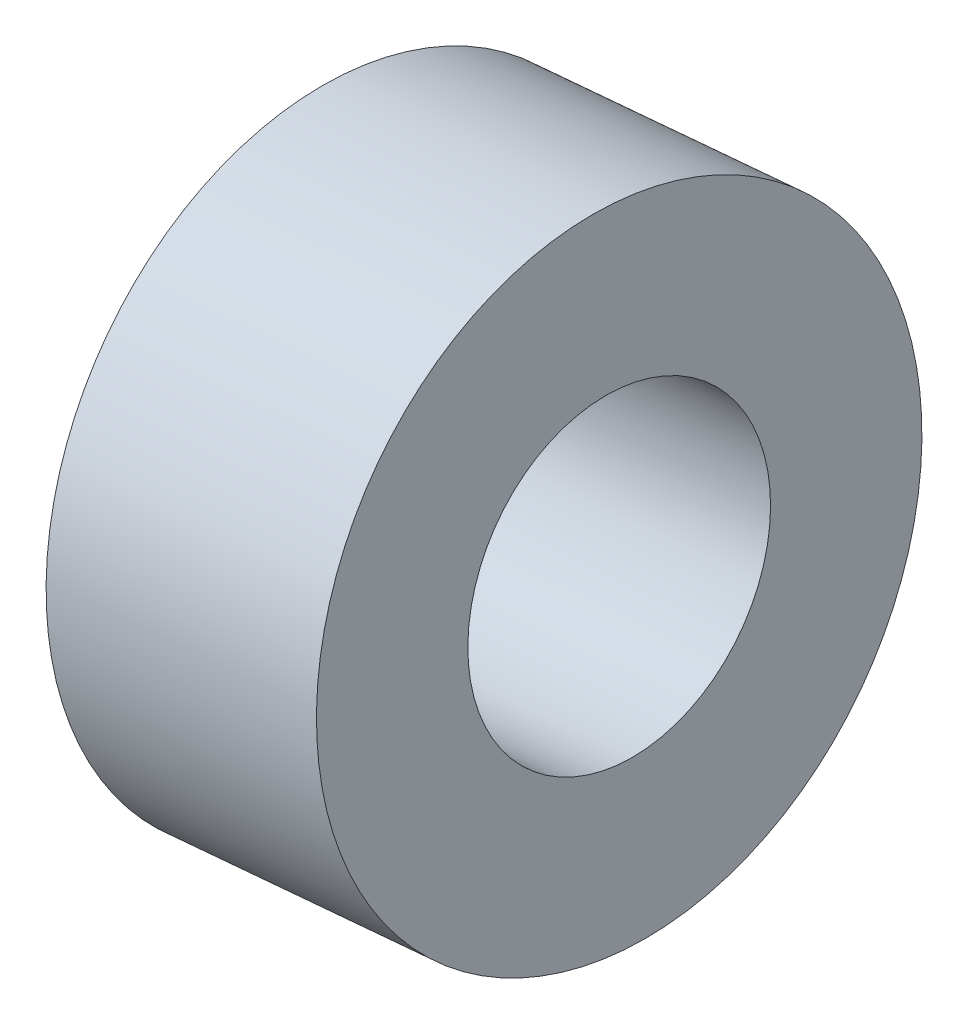
ISO-10303-21;
HEADER;
FILE_DESCRIPTION(('STEP AP214'),'2;1');
FILE_NAME('part.step','',(''),(''),'','','');
FILE_SCHEMA(('AUTOMOTIVE_DESIGN { 1 0 10303 214 1 1 1 1 }'));
ENDSEC;
DATA;
#1=APPLICATION_CONTEXT('core data for automotive mechanical design processes');
#2=APPLICATION_PROTOCOL_DEFINITION('international standard','automotive_design',2000,#1);
#3=PRODUCT_CONTEXT('',#1,'mechanical');
#4=PRODUCT('Part','Part','',(#3));
#5=PRODUCT_RELATED_PRODUCT_CATEGORY('part','',(#4));
#6=PRODUCT_DEFINITION_FORMATION('','',#4);
#7=PRODUCT_DEFINITION_CONTEXT('part definition',#1,'design');
#8=PRODUCT_DEFINITION('design','',#6,#7);
#9=PRODUCT_DEFINITION_SHAPE('','',#8);
#10=(LENGTH_UNIT() NAMED_UNIT(*) SI_UNIT(.MILLI.,.METRE.));
#11=(NAMED_UNIT(*) PLANE_ANGLE_UNIT() SI_UNIT($,.RADIAN.));
#12=(NAMED_UNIT(*) SI_UNIT($,.STERADIAN.) SOLID_ANGLE_UNIT());
#13=UNCERTAINTY_MEASURE_WITH_UNIT(LENGTH_MEASURE(1.E-05),#10,'distance_accuracy_value','');
#14=(GEOMETRIC_REPRESENTATION_CONTEXT(3) GLOBAL_UNCERTAINTY_ASSIGNED_CONTEXT((#13)) GLOBAL_UNIT_ASSIGNED_CONTEXT((#10,
#11,#12)) REPRESENTATION_CONTEXT('',''));
#15=CARTESIAN_POINT('',(0.,0.,0.));
#16=DIRECTION('',(0.,0.,1.));
#17=DIRECTION('',(1.,0.,0.));
#18=AXIS2_PLACEMENT_3D('',#15,#16,#17);
#19=CARTESIAN_POINT('',(-26.8972568484767,22.6467949458148,-2.08166817117217E-13));
#20=DIRECTION('',(-0.996194698091746,-0.0871557427476605,0.));
#21=DIRECTION('',(0.0871557427476582,-0.996194698091781,0.));
#22=AXIS2_PLACEMENT_3D('',#19,#20,#21);
#23=CYLINDRICAL_SURFACE('',#22,20.);
#24=CARTESIAN_POINT('',(-26.8972568484767,22.6467949458148,-2.08166817117217E-13));
#25=DIRECTION('',(-0.996194698091746,-0.0871557427476605,0.));
#26=DIRECTION('',(0.0871557427476582,-0.996194698091781,0.));
#27=AXIS2_PLACEMENT_3D('',#24,#25,#26);
#28=CIRCLE('',#27,20.);
#29=CARTESIAN_POINT('',(-25.1541419935235,2.72290098397922,-2.08166817117217E-13));
#30=VERTEX_POINT('',#29);
#31=EDGE_CURVE('E10',#30,#30,#28,.T.);
#32=ORIENTED_EDGE('',*,*,#31,.T.);
#33=EDGE_LOOP('',(#32));
#34=FACE_BOUND('',#33,.T.);
#35=CARTESIAN_POINT('',(-44.8287614141281,21.077991576357,0.));
#36=DIRECTION('',(-0.996194698091746,-0.0871557427476605,0.));
#37=DIRECTION('',(0.0871557427476582,-0.996194698091781,0.));
#38=AXIS2_PLACEMENT_3D('',#35,#36,#37);
#39=CIRCLE('',#38,20.);
#40=CARTESIAN_POINT('',(-43.0856465591749,1.15409761452136,0.));
#41=VERTEX_POINT('',#40);
#42=EDGE_CURVE('E37',#41,#41,#39,.T.);
#43=ORIENTED_EDGE('',*,*,#42,.F.);
#44=EDGE_LOOP('',(#43));
#45=FACE_BOUND('',#44,.T.);
#46=ADVANCED_FACE('F34',(#34,#45),#23,.T.);
#47=CARTESIAN_POINT('',(-26.8972568484767,22.6467949458148,-2.08166817117217E-13));
#48=DIRECTION('',(-0.996194698091746,-0.0871557427476605,0.));
#49=DIRECTION('',(0.0871557427476582,-0.996194698091781,0.));
#50=AXIS2_PLACEMENT_3D('',#47,#48,#49);
#51=PLANE('',#50);
#52=CARTESIAN_POINT('',(-26.8972568484767,22.6467949458148,-2.08166817117217E-13));
#53=DIRECTION('',(-0.996194698091746,-0.0871557427476605,0.));
#54=DIRECTION('',(0.0871557427476582,-0.996194698091781,0.));
#55=AXIS2_PLACEMENT_3D('',#52,#53,#54);
#56=CIRCLE('',#55,10.);
#57=CARTESIAN_POINT('',(-26.0256994210001,12.684847964897,-2.08166817117217E-13));
#58=VERTEX_POINT('',#57);
#59=EDGE_CURVE('E44',#58,#58,#56,.T.);
#60=ORIENTED_EDGE('',*,*,#59,.T.);
#61=EDGE_LOOP('',(#60));
#62=FACE_BOUND('',#61,.T.);
#63=ORIENTED_EDGE('',*,*,#31,.F.);
#64=EDGE_LOOP('',(#63));
#65=FACE_BOUND('',#64,.T.);
#66=ADVANCED_FACE('F52',(#62,#65),#51,.F.);
#67=CARTESIAN_POINT('',(-44.8287614141281,21.077991576357,0.));
#68=DIRECTION('',(-0.996194698091746,-0.0871557427476605,0.));
#69=DIRECTION('',(0.0871557427476582,-0.996194698091781,0.));
#70=AXIS2_PLACEMENT_3D('',#67,#68,#69);
#71=PLANE('',#70);
#72=CARTESIAN_POINT('',(-44.8287614141281,21.077991576357,0.));
#73=DIRECTION('',(-0.996194698091746,-0.0871557427476605,0.));
#74=DIRECTION('',(0.0871557427476582,-0.996194698091781,0.));
#75=AXIS2_PLACEMENT_3D('',#72,#73,#74);
#76=CIRCLE('',#75,10.);
#77=CARTESIAN_POINT('',(-43.9572039866515,11.1160445954392,0.));
#78=VERTEX_POINT('',#77);
#79=EDGE_CURVE('E46',#78,#78,#76,.T.);
#80=ORIENTED_EDGE('',*,*,#79,.F.);
#81=EDGE_LOOP('',(#80));
#82=FACE_BOUND('',#81,.T.);
#83=ORIENTED_EDGE('',*,*,#42,.T.);
#84=EDGE_LOOP('',(#83));
#85=FACE_BOUND('',#84,.T.);
#86=ADVANCED_FACE('F58',(#82,#85),#71,.T.);
#87=CARTESIAN_POINT('',(-26.8972568484767,22.6467949458148,-2.08166817117217E-13));
#88=DIRECTION('',(-0.996194698091746,-0.0871557427476605,0.));
#89=DIRECTION('',(0.0871557427476582,-0.996194698091781,0.));
#90=AXIS2_PLACEMENT_3D('',#87,#88,#89);
#91=CYLINDRICAL_SURFACE('',#90,10.);
#92=ORIENTED_EDGE('',*,*,#59,.F.);
#93=EDGE_LOOP('',(#92));
#94=FACE_BOUND('',#93,.T.);
#95=ORIENTED_EDGE('',*,*,#79,.T.);
#96=EDGE_LOOP('',(#95));
#97=FACE_BOUND('',#96,.T.);
#98=ADVANCED_FACE('F55',(#94,#97),#91,.F.);
#99=CLOSED_SHELL('',(#46,#66,#86,#98));
#100=MANIFOLD_SOLID_BREP('B2',#99);
#101=ADVANCED_BREP_SHAPE_REPRESENTATION('',(#18,#100),#14);
#102=SHAPE_DEFINITION_REPRESENTATION(#9,#101);
ENDSEC;
END-ISO-10303-21;
